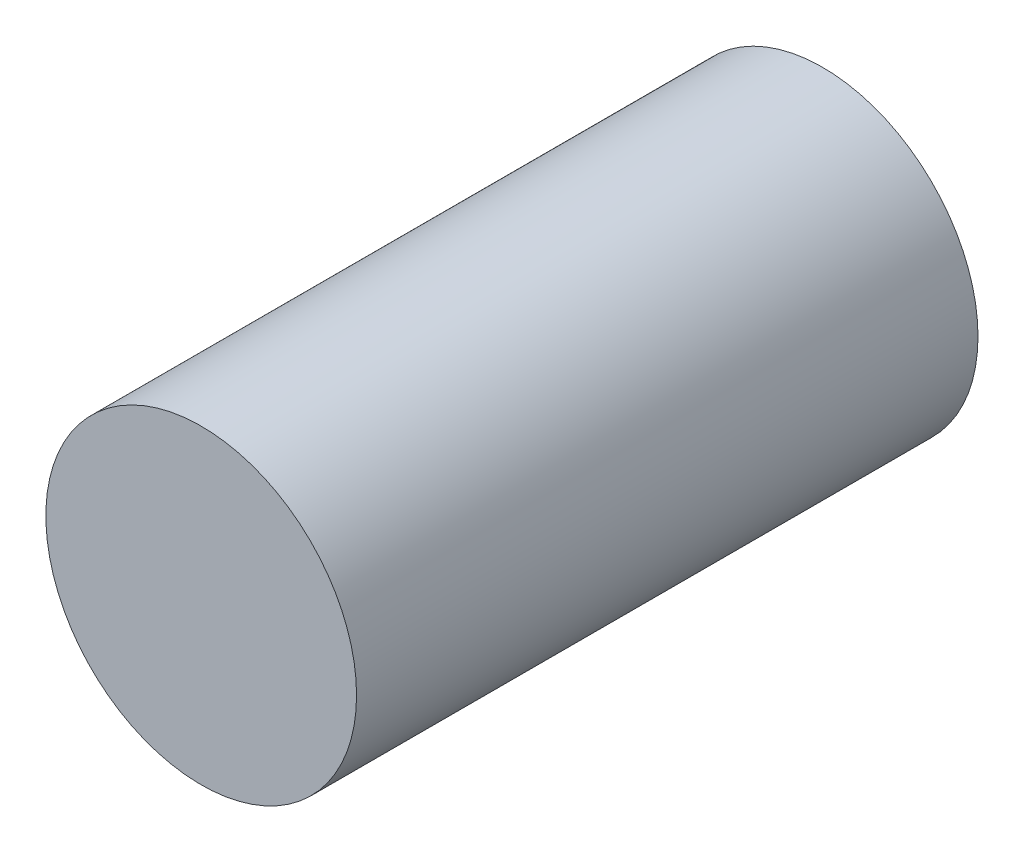
ISO-10303-21;
HEADER;
FILE_DESCRIPTION(('STEP AP214'),'2;1');
FILE_NAME('part.step','',(''),(''),'','','');
FILE_SCHEMA(('AUTOMOTIVE_DESIGN { 1 0 10303 214 1 1 1 1 }'));
ENDSEC;
DATA;
#1=APPLICATION_CONTEXT('core data for automotive mechanical design processes');
#2=APPLICATION_PROTOCOL_DEFINITION('international standard','automotive_design',2000,#1);
#3=PRODUCT_CONTEXT('',#1,'mechanical');
#4=PRODUCT('Part','Part','',(#3));
#5=PRODUCT_RELATED_PRODUCT_CATEGORY('part','',(#4));
#6=PRODUCT_DEFINITION_FORMATION('','',#4);
#7=PRODUCT_DEFINITION_CONTEXT('part definition',#1,'design');
#8=PRODUCT_DEFINITION('design','',#6,#7);
#9=PRODUCT_DEFINITION_SHAPE('','',#8);
#10=(LENGTH_UNIT() NAMED_UNIT(*) SI_UNIT(.MILLI.,.METRE.));
#11=(NAMED_UNIT(*) PLANE_ANGLE_UNIT() SI_UNIT($,.RADIAN.));
#12=(NAMED_UNIT(*) SI_UNIT($,.STERADIAN.) SOLID_ANGLE_UNIT());
#13=UNCERTAINTY_MEASURE_WITH_UNIT(LENGTH_MEASURE(1.E-05),#10,'distance_accuracy_value','');
#14=(GEOMETRIC_REPRESENTATION_CONTEXT(3) GLOBAL_UNCERTAINTY_ASSIGNED_CONTEXT((#13)) GLOBAL_UNIT_ASSIGNED_CONTEXT((#10,
#11,#12)) REPRESENTATION_CONTEXT('',''));
#15=CARTESIAN_POINT('',(0.,0.,0.));
#16=DIRECTION('',(0.,0.,1.));
#17=DIRECTION('',(1.,0.,0.));
#18=AXIS2_PLACEMENT_3D('',#15,#16,#17);
#19=CARTESIAN_POINT('',(0.,0.,127.));
#20=DIRECTION('',(0.,0.,-1.));
#21=DIRECTION('',(-1.,0.,0.));
#22=AXIS2_PLACEMENT_3D('',#19,#20,#21);
#23=CYLINDRICAL_SURFACE('',#22,63.5);
#24=CARTESIAN_POINT('',(0.,0.,127.));
#25=DIRECTION('',(0.,0.,1.));
#26=DIRECTION('',(1.,0.,0.));
#27=AXIS2_PLACEMENT_3D('',#24,#25,#26);
#28=CIRCLE('',#27,63.5);
#29=CARTESIAN_POINT('',(63.5,0.,127.));
#30=VERTEX_POINT('',#29);
#31=EDGE_CURVE('E10',#30,#30,#28,.T.);
#32=ORIENTED_EDGE('',*,*,#31,.F.);
#33=EDGE_LOOP('',(#32));
#34=FACE_BOUND('',#33,.T.);
#35=CARTESIAN_POINT('',(0.,0.,-127.));
#36=DIRECTION('',(0.,0.,1.));
#37=DIRECTION('',(1.,0.,0.));
#38=AXIS2_PLACEMENT_3D('',#35,#36,#37);
#39=CIRCLE('',#38,63.5);
#40=CARTESIAN_POINT('',(63.5,0.,-127.));
#41=VERTEX_POINT('',#40);
#42=EDGE_CURVE('E32',#41,#41,#39,.T.);
#43=ORIENTED_EDGE('',*,*,#42,.T.);
#44=EDGE_LOOP('',(#43));
#45=FACE_BOUND('',#44,.T.);
#46=ADVANCED_FACE('F29',(#34,#45),#23,.T.);
#47=CARTESIAN_POINT('',(0.,0.,127.));
#48=DIRECTION('',(0.,0.,1.));
#49=DIRECTION('',(1.,0.,0.));
#50=AXIS2_PLACEMENT_3D('',#47,#48,#49);
#51=PLANE('',#50);
#52=ORIENTED_EDGE('',*,*,#31,.T.);
#53=EDGE_LOOP('',(#52));
#54=FACE_BOUND('',#53,.T.);
#55=ADVANCED_FACE('F44',(#54),#51,.T.);
#56=CARTESIAN_POINT('',(0.,0.,-127.));
#57=DIRECTION('',(0.,0.,1.));
#58=DIRECTION('',(1.,0.,0.));
#59=AXIS2_PLACEMENT_3D('',#56,#57,#58);
#60=PLANE('',#59);
#61=ORIENTED_EDGE('',*,*,#42,.F.);
#62=EDGE_LOOP('',(#61));
#63=FACE_BOUND('',#62,.T.);
#64=ADVANCED_FACE('F42',(#63),#60,.F.);
#65=CLOSED_SHELL('',(#46,#55,#64));
#66=MANIFOLD_SOLID_BREP('B2',#65);
#67=ADVANCED_BREP_SHAPE_REPRESENTATION('',(#18,#66),#14);
#68=SHAPE_DEFINITION_REPRESENTATION(#9,#67);
ENDSEC;
END-ISO-10303-21;
